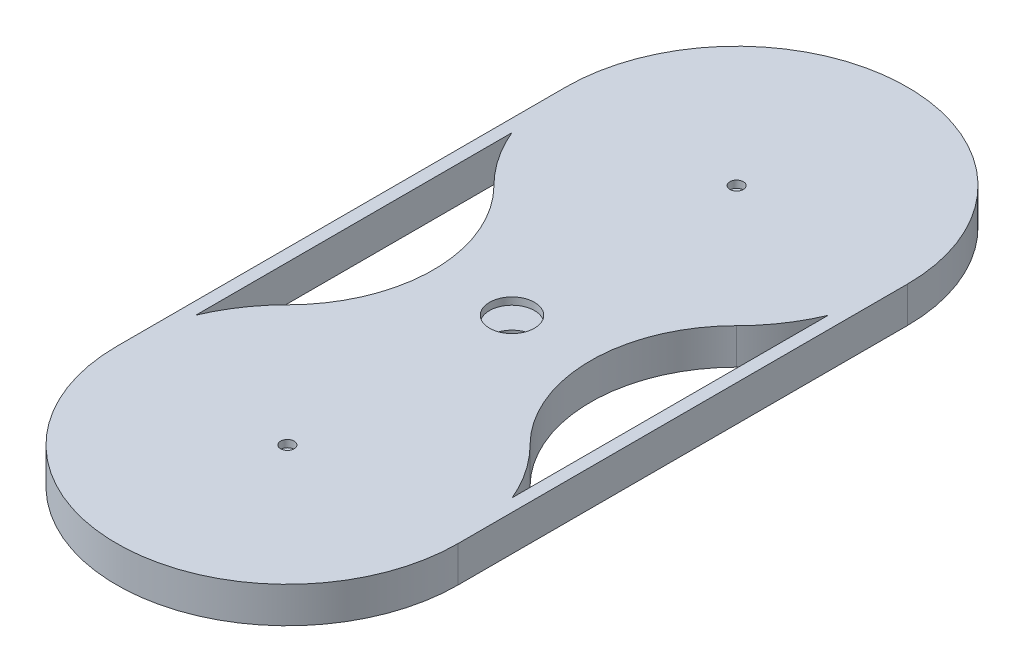
ISO-10303-21;
HEADER;
FILE_DESCRIPTION(('STEP AP214'),'2;1');
FILE_NAME('part.step','',(''),(''),'','','');
FILE_SCHEMA(('AUTOMOTIVE_DESIGN { 1 0 10303 214 1 1 1 1 }'));
ENDSEC;
DATA;
#1=APPLICATION_CONTEXT('core data for automotive mechanical design processes');
#2=APPLICATION_PROTOCOL_DEFINITION('international standard','automotive_design',2000,#1);
#3=PRODUCT_CONTEXT('',#1,'mechanical');
#4=PRODUCT('Part','Part','',(#3));
#5=PRODUCT_RELATED_PRODUCT_CATEGORY('part','',(#4));
#6=PRODUCT_DEFINITION_FORMATION('','',#4);
#7=PRODUCT_DEFINITION_CONTEXT('part definition',#1,'design');
#8=PRODUCT_DEFINITION('design','',#6,#7);
#9=PRODUCT_DEFINITION_SHAPE('','',#8);
#10=(LENGTH_UNIT() NAMED_UNIT(*) SI_UNIT(.MILLI.,.METRE.));
#11=(NAMED_UNIT(*) PLANE_ANGLE_UNIT() SI_UNIT($,.RADIAN.));
#12=(NAMED_UNIT(*) SI_UNIT($,.STERADIAN.) SOLID_ANGLE_UNIT());
#13=UNCERTAINTY_MEASURE_WITH_UNIT(LENGTH_MEASURE(1.E-05),#10,'distance_accuracy_value','');
#14=(GEOMETRIC_REPRESENTATION_CONTEXT(3) GLOBAL_UNCERTAINTY_ASSIGNED_CONTEXT((#13)) GLOBAL_UNIT_ASSIGNED_CONTEXT((#10,
#11,#12)) REPRESENTATION_CONTEXT('',''));
#15=CARTESIAN_POINT('',(0.,0.,0.));
#16=DIRECTION('',(0.,0.,1.));
#17=DIRECTION('',(1.,0.,0.));
#18=AXIS2_PLACEMENT_3D('',#15,#16,#17);
#19=CARTESIAN_POINT('',(0.,-2.,0.));
#20=DIRECTION('',(0.,1.,0.));
#21=DIRECTION('',(0.,0.,1.));
#22=AXIS2_PLACEMENT_3D('',#19,#20,#21);
#23=PLANE('',#22);
#24=CARTESIAN_POINT('',(0.,-2.,0.));
#25=DIRECTION('',(0.,1.,0.));
#26=DIRECTION('',(0.,0.,1.));
#27=AXIS2_PLACEMENT_3D('',#24,#25,#26);
#28=CIRCLE('',#27,19.1);
#29=CARTESIAN_POINT('',(13.505739520663,-2.,13.5057395206631));
#30=VERTEX_POINT('',#29);
#31=CARTESIAN_POINT('',(17.6,-2.,7.41956872061983));
#32=VERTEX_POINT('',#31);
#33=EDGE_CURVE('E316',#30,#32,#28,.T.);
#34=ORIENTED_EDGE('',*,*,#33,.F.);
#35=CARTESIAN_POINT('',(25.,-2.,25.));
#36=DIRECTION('',(0.,1.,0.));
#37=DIRECTION('',(0.,0.,1.));
#38=AXIS2_PLACEMENT_3D('',#35,#36,#37);
#39=CIRCLE('',#38,16.2553390593274);
#40=CARTESIAN_POINT('',(13.5057395206631,-2.,36.494260479337));
#41=VERTEX_POINT('',#40);
#42=EDGE_CURVE('E321',#41,#30,#39,.F.);
#43=ORIENTED_EDGE('',*,*,#42,.F.);
#44=CARTESIAN_POINT('',(0.,-2.,50.));
#45=DIRECTION('',(0.,1.,0.));
#46=DIRECTION('',(0.,0.,1.));
#47=AXIS2_PLACEMENT_3D('',#44,#45,#46);
#48=CIRCLE('',#47,19.1);
#49=CARTESIAN_POINT('',(17.6,-2.,42.5804312793802));
#50=VERTEX_POINT('',#49);
#51=EDGE_CURVE('E179',#50,#41,#48,.T.);
#52=ORIENTED_EDGE('',*,*,#51,.F.);
#53=DIRECTION('',(0.,0.,1.));
#54=VECTOR('',#53,1.);
#55=CARTESIAN_POINT('',(17.6,-2.,0.));
#56=LINE('',#55,#54);
#57=EDGE_CURVE('E318',#32,#50,#56,.T.);
#58=ORIENTED_EDGE('',*,*,#57,.F.);
#59=EDGE_LOOP('',(#34,#43,#52,#58));
#60=FACE_BOUND('',#59,.T.);
#61=CARTESIAN_POINT('',(0.,-2.,50.));
#62=DIRECTION('',(0.,1.,0.));
#63=DIRECTION('',(0.,0.,1.));
#64=AXIS2_PLACEMENT_3D('',#61,#62,#63);
#65=CIRCLE('',#64,19.1);
#66=CARTESIAN_POINT('',(-13.505739520663,-2.,36.494260479337));
#67=VERTEX_POINT('',#66);
#68=CARTESIAN_POINT('',(-17.6,-2.,42.5804312793802));
#69=VERTEX_POINT('',#68);
#70=EDGE_CURVE('E208',#67,#69,#65,.T.);
#71=ORIENTED_EDGE('',*,*,#70,.F.);
#72=CARTESIAN_POINT('',(-25.0000000000001,-2.,25.));
#73=DIRECTION('',(0.,1.,0.));
#74=DIRECTION('',(0.,0.,1.));
#75=AXIS2_PLACEMENT_3D('',#72,#73,#74);
#76=CIRCLE('',#75,16.2553390593275);
#77=CARTESIAN_POINT('',(-13.5057395206631,-2.,13.505739520663));
#78=VERTEX_POINT('',#77);
#79=EDGE_CURVE('E303',#78,#67,#76,.F.);
#80=ORIENTED_EDGE('',*,*,#79,.F.);
#81=CARTESIAN_POINT('',(0.,-2.,0.));
#82=DIRECTION('',(0.,1.,0.));
#83=DIRECTION('',(0.,0.,1.));
#84=AXIS2_PLACEMENT_3D('',#81,#82,#83);
#85=CIRCLE('',#84,19.0999999999999);
#86=CARTESIAN_POINT('',(-17.6,-2.,7.41956872061955));
#87=VERTEX_POINT('',#86);
#88=EDGE_CURVE('E300',#87,#78,#85,.T.);
#89=ORIENTED_EDGE('',*,*,#88,.F.);
#90=DIRECTION('',(0.,0.,-1.));
#91=VECTOR('',#90,1.);
#92=CARTESIAN_POINT('',(-17.6,-2.,0.));
#93=LINE('',#92,#91);
#94=EDGE_CURVE('E298',#69,#87,#93,.T.);
#95=ORIENTED_EDGE('',*,*,#94,.F.);
#96=EDGE_LOOP('',(#71,#80,#89,#95));
#97=FACE_BOUND('',#96,.T.);
#98=CARTESIAN_POINT('',(0.,-2.,25.));
#99=DIRECTION('',(0.,-1.,0.));
#100=DIRECTION('',(0.,0.,-1.));
#101=AXIS2_PLACEMENT_3D('',#98,#99,#100);
#102=CIRCLE('',#101,2.5);
#103=CARTESIAN_POINT('',(0.,-2.,22.5));
#104=VERTEX_POINT('',#103);
#105=EDGE_CURVE('E213',#104,#104,#102,.T.);
#106=ORIENTED_EDGE('',*,*,#105,.F.);
#107=EDGE_LOOP('',(#106));
#108=FACE_BOUND('',#107,.T.);
#109=CARTESIAN_POINT('',(0.,-2.,50.));
#110=DIRECTION('',(0.,-1.,0.));
#111=DIRECTION('',(0.,0.,-1.));
#112=AXIS2_PLACEMENT_3D('',#109,#110,#111);
#113=CIRCLE('',#112,2.2);
#114=CARTESIAN_POINT('',(0.,-2.,47.8));
#115=VERTEX_POINT('',#114);
#116=EDGE_CURVE('E218',#115,#115,#113,.T.);
#117=ORIENTED_EDGE('',*,*,#116,.F.);
#118=EDGE_LOOP('',(#117));
#119=FACE_BOUND('',#118,.T.);
#120=CARTESIAN_POINT('',(0.,-2.,0.));
#121=DIRECTION('',(0.,-1.,0.));
#122=DIRECTION('',(0.,0.,-1.));
#123=AXIS2_PLACEMENT_3D('',#120,#121,#122);
#124=CIRCLE('',#123,2.2);
#125=CARTESIAN_POINT('',(0.,-2.,-2.2));
#126=VERTEX_POINT('',#125);
#127=EDGE_CURVE('E217',#126,#126,#124,.T.);
#128=ORIENTED_EDGE('',*,*,#127,.F.);
#129=EDGE_LOOP('',(#128));
#130=FACE_BOUND('',#129,.T.);
#131=CARTESIAN_POINT('',(0.,-2.,0.));
#132=DIRECTION('',(0.,1.,0.));
#133=DIRECTION('',(0.,0.,1.));
#134=AXIS2_PLACEMENT_3D('',#131,#132,#133);
#135=CIRCLE('',#134,19.);
#136=CARTESIAN_POINT('',(19.,-2.,0.));
#137=VERTEX_POINT('',#136);
#138=CARTESIAN_POINT('',(-19.,-2.,0.));
#139=VERTEX_POINT('',#138);
#140=EDGE_CURVE('E239',#137,#139,#135,.T.);
#141=ORIENTED_EDGE('',*,*,#140,.F.);
#142=DIRECTION('',(0.,0.,-1.));
#143=VECTOR('',#142,1.);
#144=CARTESIAN_POINT('',(19.,-2.,0.));
#145=LINE('',#144,#143);
#146=CARTESIAN_POINT('',(19.,-2.,50.));
#147=VERTEX_POINT('',#146);
#148=EDGE_CURVE('E226',#147,#137,#145,.T.);
#149=ORIENTED_EDGE('',*,*,#148,.F.);
#150=CARTESIAN_POINT('',(0.,-2.,50.));
#151=DIRECTION('',(0.,1.,0.));
#152=DIRECTION('',(0.,0.,1.));
#153=AXIS2_PLACEMENT_3D('',#150,#151,#152);
#154=CIRCLE('',#153,19.);
#155=CARTESIAN_POINT('',(-19.,-2.,50.));
#156=VERTEX_POINT('',#155);
#157=EDGE_CURVE('E233',#156,#147,#154,.T.);
#158=ORIENTED_EDGE('',*,*,#157,.F.);
#159=DIRECTION('',(0.,0.,1.));
#160=VECTOR('',#159,1.);
#161=CARTESIAN_POINT('',(-19.,-2.,0.));
#162=LINE('',#161,#160);
#163=EDGE_CURVE('E236',#139,#156,#162,.T.);
#164=ORIENTED_EDGE('',*,*,#163,.F.);
#165=EDGE_LOOP('',(#141,#149,#158,#164));
#166=FACE_BOUND('',#165,.T.);
#167=ADVANCED_FACE('F57',(#60,#97,#108,#119,#130,#166),#23,.F.);
#168=CARTESIAN_POINT('',(0.,-2.,0.));
#169=DIRECTION('',(0.,1.,0.));
#170=DIRECTION('',(0.,0.,1.));
#171=AXIS2_PLACEMENT_3D('',#168,#169,#170);
#172=CYLINDRICAL_SURFACE('',#171,19.);
#173=DIRECTION('',(0.,1.,0.));
#174=VECTOR('',#173,1.);
#175=CARTESIAN_POINT('',(-19.,-2.,0.));
#176=LINE('',#175,#174);
#177=CARTESIAN_POINT('',(-19.,2.,0.));
#178=VERTEX_POINT('',#177);
#179=EDGE_CURVE('E223',#139,#178,#176,.T.);
#180=ORIENTED_EDGE('',*,*,#179,.T.);
#181=CARTESIAN_POINT('',(0.,2.,0.));
#182=DIRECTION('',(0.,1.,0.));
#183=DIRECTION('',(0.,0.,1.));
#184=AXIS2_PLACEMENT_3D('',#181,#182,#183);
#185=CIRCLE('',#184,19.);
#186=CARTESIAN_POINT('',(19.,2.,0.));
#187=VERTEX_POINT('',#186);
#188=EDGE_CURVE('E251',#187,#178,#185,.T.);
#189=ORIENTED_EDGE('',*,*,#188,.F.);
#190=DIRECTION('',(0.,1.,0.));
#191=VECTOR('',#190,1.);
#192=CARTESIAN_POINT('',(19.,-2.,0.));
#193=LINE('',#192,#191);
#194=EDGE_CURVE('E199',#137,#187,#193,.T.);
#195=ORIENTED_EDGE('',*,*,#194,.F.);
#196=ORIENTED_EDGE('',*,*,#140,.T.);
#197=EDGE_LOOP('',(#180,#189,#195,#196));
#198=FACE_BOUND('',#197,.T.);
#199=ADVANCED_FACE('F59',(#198),#172,.T.);
#200=CARTESIAN_POINT('',(19.,-2.,0.));
#201=DIRECTION('',(1.,0.,0.));
#202=DIRECTION('',(0.,0.,-1.));
#203=AXIS2_PLACEMENT_3D('',#200,#201,#202);
#204=PLANE('',#203);
#205=ORIENTED_EDGE('',*,*,#194,.T.);
#206=DIRECTION('',(0.,0.,-1.));
#207=VECTOR('',#206,1.);
#208=CARTESIAN_POINT('',(19.,2.,0.));
#209=LINE('',#208,#207);
#210=CARTESIAN_POINT('',(19.,2.,50.));
#211=VERTEX_POINT('',#210);
#212=EDGE_CURVE('E242',#211,#187,#209,.T.);
#213=ORIENTED_EDGE('',*,*,#212,.F.);
#214=DIRECTION('',(0.,1.,0.));
#215=VECTOR('',#214,1.);
#216=CARTESIAN_POINT('',(19.,-2.,50.));
#217=LINE('',#216,#215);
#218=EDGE_CURVE('E228',#147,#211,#217,.T.);
#219=ORIENTED_EDGE('',*,*,#218,.F.);
#220=ORIENTED_EDGE('',*,*,#148,.T.);
#221=EDGE_LOOP('',(#205,#213,#219,#220));
#222=FACE_BOUND('',#221,.T.);
#223=ADVANCED_FACE('F352',(#222),#204,.T.);
#224=CARTESIAN_POINT('',(0.,-2.,50.));
#225=DIRECTION('',(0.,1.,0.));
#226=DIRECTION('',(0.,0.,1.));
#227=AXIS2_PLACEMENT_3D('',#224,#225,#226);
#228=CYLINDRICAL_SURFACE('',#227,19.);
#229=ORIENTED_EDGE('',*,*,#218,.T.);
#230=CARTESIAN_POINT('',(0.,2.,50.));
#231=DIRECTION('',(0.,1.,0.));
#232=DIRECTION('',(0.,0.,1.));
#233=AXIS2_PLACEMENT_3D('',#230,#231,#232);
#234=CIRCLE('',#233,19.);
#235=CARTESIAN_POINT('',(-19.,2.,50.));
#236=VERTEX_POINT('',#235);
#237=EDGE_CURVE('E245',#236,#211,#234,.T.);
#238=ORIENTED_EDGE('',*,*,#237,.F.);
#239=DIRECTION('',(0.,1.,0.));
#240=VECTOR('',#239,1.);
#241=CARTESIAN_POINT('',(-19.,-2.,50.));
#242=LINE('',#241,#240);
#243=EDGE_CURVE('E225',#156,#236,#242,.T.);
#244=ORIENTED_EDGE('',*,*,#243,.F.);
#245=ORIENTED_EDGE('',*,*,#157,.T.);
#246=EDGE_LOOP('',(#229,#238,#244,#245));
#247=FACE_BOUND('',#246,.T.);
#248=ADVANCED_FACE('F359',(#247),#228,.T.);
#249=CARTESIAN_POINT('',(-19.,-2.,0.));
#250=DIRECTION('',(-1.,0.,0.));
#251=DIRECTION('',(0.,0.,1.));
#252=AXIS2_PLACEMENT_3D('',#249,#250,#251);
#253=PLANE('',#252);
#254=ORIENTED_EDGE('',*,*,#243,.T.);
#255=DIRECTION('',(0.,0.,1.));
#256=VECTOR('',#255,1.);
#257=CARTESIAN_POINT('',(-19.,2.,0.));
#258=LINE('',#257,#256);
#259=EDGE_CURVE('E248',#178,#236,#258,.T.);
#260=ORIENTED_EDGE('',*,*,#259,.F.);
#261=ORIENTED_EDGE('',*,*,#179,.F.);
#262=ORIENTED_EDGE('',*,*,#163,.T.);
#263=EDGE_LOOP('',(#254,#260,#261,#262));
#264=FACE_BOUND('',#263,.T.);
#265=ADVANCED_FACE('F362',(#264),#253,.T.);
#266=CARTESIAN_POINT('',(0.,2.,0.));
#267=DIRECTION('',(0.,1.,0.));
#268=DIRECTION('',(0.,0.,1.));
#269=AXIS2_PLACEMENT_3D('',#266,#267,#268);
#270=PLANE('',#269);
#271=CARTESIAN_POINT('',(25.,2.,25.));
#272=DIRECTION('',(0.,1.,0.));
#273=DIRECTION('',(0.,0.,1.));
#274=AXIS2_PLACEMENT_3D('',#271,#272,#273);
#275=CIRCLE('',#274,16.2553390593274);
#276=CARTESIAN_POINT('',(13.5057395206631,2.,36.494260479337));
#277=VERTEX_POINT('',#276);
#278=CARTESIAN_POINT('',(13.505739520663,2.,13.5057395206631));
#279=VERTEX_POINT('',#278);
#280=EDGE_CURVE('E167',#277,#279,#275,.F.);
#281=ORIENTED_EDGE('',*,*,#280,.T.);
#282=CARTESIAN_POINT('',(0.,2.,0.));
#283=DIRECTION('',(0.,1.,0.));
#284=DIRECTION('',(0.,0.,1.));
#285=AXIS2_PLACEMENT_3D('',#282,#283,#284);
#286=CIRCLE('',#285,19.1);
#287=CARTESIAN_POINT('',(17.6,2.,7.41956872061983));
#288=VERTEX_POINT('',#287);
#289=EDGE_CURVE('E12',#279,#288,#286,.T.);
#290=ORIENTED_EDGE('',*,*,#289,.T.);
#291=DIRECTION('',(0.,0.,1.));
#292=VECTOR('',#291,1.);
#293=CARTESIAN_POINT('',(17.6,2.,0.));
#294=LINE('',#293,#292);
#295=CARTESIAN_POINT('',(17.6,2.,42.5804312793802));
#296=VERTEX_POINT('',#295);
#297=EDGE_CURVE('E65',#288,#296,#294,.T.);
#298=ORIENTED_EDGE('',*,*,#297,.T.);
#299=CARTESIAN_POINT('',(0.,2.,50.));
#300=DIRECTION('',(0.,1.,0.));
#301=DIRECTION('',(0.,0.,1.));
#302=AXIS2_PLACEMENT_3D('',#299,#300,#301);
#303=CIRCLE('',#302,19.1);
#304=EDGE_CURVE('E171',#296,#277,#303,.T.);
#305=ORIENTED_EDGE('',*,*,#304,.T.);
#306=EDGE_LOOP('',(#281,#290,#298,#305));
#307=FACE_BOUND('',#306,.T.);
#308=CARTESIAN_POINT('',(-25.0000000000001,2.,25.));
#309=DIRECTION('',(0.,1.,0.));
#310=DIRECTION('',(0.,0.,1.));
#311=AXIS2_PLACEMENT_3D('',#308,#309,#310);
#312=CIRCLE('',#311,16.2553390593275);
#313=CARTESIAN_POINT('',(-13.505739520663,2.,13.505739520663));
#314=VERTEX_POINT('',#313);
#315=CARTESIAN_POINT('',(-13.505739520663,2.,36.494260479337));
#316=VERTEX_POINT('',#315);
#317=EDGE_CURVE('E196',#314,#316,#312,.F.);
#318=ORIENTED_EDGE('',*,*,#317,.T.);
#319=CARTESIAN_POINT('',(0.,2.,50.));
#320=DIRECTION('',(0.,1.,0.));
#321=DIRECTION('',(0.,0.,1.));
#322=AXIS2_PLACEMENT_3D('',#319,#320,#321);
#323=CIRCLE('',#322,19.1);
#324=CARTESIAN_POINT('',(-17.6,2.,42.5804312793802));
#325=VERTEX_POINT('',#324);
#326=EDGE_CURVE('E172',#316,#325,#323,.T.);
#327=ORIENTED_EDGE('',*,*,#326,.T.);
#328=DIRECTION('',(0.,0.,-1.));
#329=VECTOR('',#328,1.);
#330=CARTESIAN_POINT('',(-17.6,2.,0.));
#331=LINE('',#330,#329);
#332=CARTESIAN_POINT('',(-17.6,2.,7.41956872061955));
#333=VERTEX_POINT('',#332);
#334=EDGE_CURVE('E190',#325,#333,#331,.T.);
#335=ORIENTED_EDGE('',*,*,#334,.T.);
#336=CARTESIAN_POINT('',(0.,2.,0.));
#337=DIRECTION('',(0.,1.,0.));
#338=DIRECTION('',(0.,0.,1.));
#339=AXIS2_PLACEMENT_3D('',#336,#337,#338);
#340=CIRCLE('',#339,19.0999999999999);
#341=EDGE_CURVE('E193',#333,#314,#340,.T.);
#342=ORIENTED_EDGE('',*,*,#341,.T.);
#343=EDGE_LOOP('',(#318,#327,#335,#342));
#344=FACE_BOUND('',#343,.T.);
#345=CARTESIAN_POINT('',(0.,2.,50.));
#346=DIRECTION('',(0.,1.,0.));
#347=DIRECTION('',(0.,0.,1.));
#348=AXIS2_PLACEMENT_3D('',#345,#346,#347);
#349=CIRCLE('',#348,0.75);
#350=CARTESIAN_POINT('',(0.,2.,50.75));
#351=VERTEX_POINT('',#350);
#352=EDGE_CURVE('E203',#351,#351,#349,.T.);
#353=ORIENTED_EDGE('',*,*,#352,.F.);
#354=EDGE_LOOP('',(#353));
#355=FACE_BOUND('',#354,.T.);
#356=CARTESIAN_POINT('',(0.,2.,0.));
#357=DIRECTION('',(0.,1.,0.));
#358=DIRECTION('',(0.,0.,1.));
#359=AXIS2_PLACEMENT_3D('',#356,#357,#358);
#360=CIRCLE('',#359,0.75);
#361=CARTESIAN_POINT('',(0.,2.,0.75));
#362=VERTEX_POINT('',#361);
#363=EDGE_CURVE('E204',#362,#362,#360,.T.);
#364=ORIENTED_EDGE('',*,*,#363,.F.);
#365=EDGE_LOOP('',(#364));
#366=FACE_BOUND('',#365,.T.);
#367=CARTESIAN_POINT('',(0.,2.,25.));
#368=DIRECTION('',(0.,1.,0.));
#369=DIRECTION('',(0.,0.,1.));
#370=AXIS2_PLACEMENT_3D('',#367,#368,#369);
#371=CIRCLE('',#370,2.5);
#372=CARTESIAN_POINT('',(0.,2.,27.5));
#373=VERTEX_POINT('',#372);
#374=EDGE_CURVE('E286',#373,#373,#371,.T.);
#375=ORIENTED_EDGE('',*,*,#374,.F.);
#376=EDGE_LOOP('',(#375));
#377=FACE_BOUND('',#376,.T.);
#378=ORIENTED_EDGE('',*,*,#188,.T.);
#379=ORIENTED_EDGE('',*,*,#259,.T.);
#380=ORIENTED_EDGE('',*,*,#237,.T.);
#381=ORIENTED_EDGE('',*,*,#212,.T.);
#382=EDGE_LOOP('',(#378,#379,#380,#381));
#383=FACE_BOUND('',#382,.T.);
#384=ADVANCED_FACE('F184',(#307,#344,#355,#366,#377,#383),#270,.T.);
#385=CARTESIAN_POINT('',(0.,0.2,0.));
#386=DIRECTION('',(0.,-1.,0.));
#387=DIRECTION('',(0.,0.,-1.));
#388=AXIS2_PLACEMENT_3D('',#385,#386,#387);
#389=CYLINDRICAL_SURFACE('',#388,2.2);
#390=CARTESIAN_POINT('',(0.,-1.2,0.));
#391=DIRECTION('',(0.,1.,0.));
#392=DIRECTION('',(0.,0.,1.));
#393=AXIS2_PLACEMENT_3D('',#390,#391,#392);
#394=CIRCLE('',#393,2.2);
#395=CARTESIAN_POINT('',(0.,-1.2,2.2));
#396=VERTEX_POINT('',#395);
#397=EDGE_CURVE('E219',#396,#396,#394,.T.);
#398=ORIENTED_EDGE('',*,*,#397,.T.);
#399=EDGE_LOOP('',(#398));
#400=FACE_BOUND('',#399,.T.);
#401=ORIENTED_EDGE('',*,*,#127,.T.);
#402=EDGE_LOOP('',(#401));
#403=FACE_BOUND('',#402,.T.);
#404=ADVANCED_FACE('F369',(#400,#403),#389,.F.);
#405=CARTESIAN_POINT('',(25.,1.2,25.));
#406=DIRECTION('',(0.,-1.,0.));
#407=DIRECTION('',(0.,0.,-1.));
#408=AXIS2_PLACEMENT_3D('',#405,#406,#407);
#409=CYLINDRICAL_SURFACE('',#408,17.7553390593274);
#410=DIRECTION('',(0.,-1.,0.));
#411=VECTOR('',#410,1.);
#412=CARTESIAN_POINT('',(12.4450793488832,1.2,37.5549206511168));
#413=LINE('',#412,#411);
#414=CARTESIAN_POINT('',(12.4450793488832,1.2,37.5549206511168));
#415=VERTEX_POINT('',#414);
#416=CARTESIAN_POINT('',(12.4450793488832,-1.2,37.5549206511168));
#417=VERTEX_POINT('',#416);
#418=EDGE_CURVE('E260',#415,#417,#413,.T.);
#419=ORIENTED_EDGE('',*,*,#418,.F.);
#420=CARTESIAN_POINT('',(25.,1.2,25.));
#421=DIRECTION('',(0.,1.,0.));
#422=DIRECTION('',(0.,0.,1.));
#423=AXIS2_PLACEMENT_3D('',#420,#421,#422);
#424=CIRCLE('',#423,17.7553390593274);
#425=CARTESIAN_POINT('',(12.4450793488832,1.2,12.4450793488832));
#426=VERTEX_POINT('',#425);
#427=EDGE_CURVE('E268',#426,#415,#424,.T.);
#428=ORIENTED_EDGE('',*,*,#427,.F.);
#429=DIRECTION('',(0.,-1.,0.));
#430=VECTOR('',#429,1.);
#431=CARTESIAN_POINT('',(12.4450793488832,1.2,12.4450793488832));
#432=LINE('',#431,#430);
#433=CARTESIAN_POINT('',(12.4450793488832,-1.2,12.4450793488832));
#434=VERTEX_POINT('',#433);
#435=EDGE_CURVE('E254',#426,#434,#432,.T.);
#436=ORIENTED_EDGE('',*,*,#435,.T.);
#437=CARTESIAN_POINT('',(25.,-1.2,25.));
#438=DIRECTION('',(0.,1.,0.));
#439=DIRECTION('',(0.,0.,1.));
#440=AXIS2_PLACEMENT_3D('',#437,#438,#439);
#441=CIRCLE('',#440,17.7553390593274);
#442=EDGE_CURVE('E222',#434,#417,#441,.T.);
#443=ORIENTED_EDGE('',*,*,#442,.T.);
#444=EDGE_LOOP('',(#419,#428,#436,#443));
#445=FACE_BOUND('',#444,.T.);
#446=ADVANCED_FACE('F383',(#445),#409,.T.);
#447=CARTESIAN_POINT('',(0.,1.2,0.));
#448=DIRECTION('',(0.,-1.,0.));
#449=DIRECTION('',(0.,0.,-1.));
#450=AXIS2_PLACEMENT_3D('',#447,#448,#449);
#451=CYLINDRICAL_SURFACE('',#450,17.6);
#452=ORIENTED_EDGE('',*,*,#435,.F.);
#453=CARTESIAN_POINT('',(0.,1.2,0.));
#454=DIRECTION('',(0.,1.,0.));
#455=DIRECTION('',(0.,0.,1.));
#456=AXIS2_PLACEMENT_3D('',#453,#454,#455);
#457=CIRCLE('',#456,17.6);
#458=CARTESIAN_POINT('',(-12.4450793488833,1.2,12.4450793488832));
#459=VERTEX_POINT('',#458);
#460=EDGE_CURVE('E266',#426,#459,#457,.T.);
#461=ORIENTED_EDGE('',*,*,#460,.T.);
#462=DIRECTION('',(0.,-1.,0.));
#463=VECTOR('',#462,1.);
#464=CARTESIAN_POINT('',(-12.4450793488833,1.2,12.4450793488832));
#465=LINE('',#464,#463);
#466=CARTESIAN_POINT('',(-12.4450793488833,-1.2,12.4450793488832));
#467=VERTEX_POINT('',#466);
#468=EDGE_CURVE('E256',#459,#467,#465,.T.);
#469=ORIENTED_EDGE('',*,*,#468,.T.);
#470=CARTESIAN_POINT('',(0.,-1.2,0.));
#471=DIRECTION('',(0.,1.,0.));
#472=DIRECTION('',(0.,0.,1.));
#473=AXIS2_PLACEMENT_3D('',#470,#471,#472);
#474=CIRCLE('',#473,17.6);
#475=EDGE_CURVE('E277',#434,#467,#474,.T.);
#476=ORIENTED_EDGE('',*,*,#475,.F.);
#477=EDGE_LOOP('',(#452,#461,#469,#476));
#478=FACE_BOUND('',#477,.T.);
#479=ADVANCED_FACE('F389',(#478),#451,.F.);
#480=CARTESIAN_POINT('',(-25.0000000000001,1.2,25.));
#481=DIRECTION('',(0.,-1.,0.));
#482=DIRECTION('',(0.,0.,-1.));
#483=AXIS2_PLACEMENT_3D('',#480,#481,#482);
#484=CYLINDRICAL_SURFACE('',#483,17.7553390593275);
#485=ORIENTED_EDGE('',*,*,#468,.F.);
#486=CARTESIAN_POINT('',(-25.0000000000001,1.2,25.));
#487=DIRECTION('',(0.,1.,0.));
#488=DIRECTION('',(0.,0.,1.));
#489=AXIS2_PLACEMENT_3D('',#486,#487,#488);
#490=CIRCLE('',#489,17.7553390593275);
#491=CARTESIAN_POINT('',(-12.4450793488832,1.2,37.5549206511168));
#492=VERTEX_POINT('',#491);
#493=EDGE_CURVE('E264',#459,#492,#490,.F.);
#494=ORIENTED_EDGE('',*,*,#493,.T.);
#495=DIRECTION('',(0.,-1.,0.));
#496=VECTOR('',#495,1.);
#497=CARTESIAN_POINT('',(-12.4450793488832,1.2,37.5549206511168));
#498=LINE('',#497,#496);
#499=CARTESIAN_POINT('',(-12.4450793488832,-1.2,37.5549206511168));
#500=VERTEX_POINT('',#499);
#501=EDGE_CURVE('E258',#492,#500,#498,.T.);
#502=ORIENTED_EDGE('',*,*,#501,.T.);
#503=CARTESIAN_POINT('',(-25.0000000000001,-1.2,25.));
#504=DIRECTION('',(0.,1.,0.));
#505=DIRECTION('',(0.,0.,1.));
#506=AXIS2_PLACEMENT_3D('',#503,#504,#505);
#507=CIRCLE('',#506,17.7553390593275);
#508=EDGE_CURVE('E274',#467,#500,#507,.F.);
#509=ORIENTED_EDGE('',*,*,#508,.F.);
#510=EDGE_LOOP('',(#485,#494,#502,#509));
#511=FACE_BOUND('',#510,.T.);
#512=ADVANCED_FACE('F407',(#511),#484,.T.);
#513=CARTESIAN_POINT('',(0.,1.2,50.));
#514=DIRECTION('',(0.,-1.,0.));
#515=DIRECTION('',(0.,0.,-1.));
#516=AXIS2_PLACEMENT_3D('',#513,#514,#515);
#517=CYLINDRICAL_SURFACE('',#516,17.6);
#518=ORIENTED_EDGE('',*,*,#501,.F.);
#519=CARTESIAN_POINT('',(0.,1.2,50.));
#520=DIRECTION('',(0.,1.,0.));
#521=DIRECTION('',(0.,0.,1.));
#522=AXIS2_PLACEMENT_3D('',#519,#520,#521);
#523=CIRCLE('',#522,17.6);
#524=EDGE_CURVE('E262',#492,#415,#523,.T.);
#525=ORIENTED_EDGE('',*,*,#524,.T.);
#526=ORIENTED_EDGE('',*,*,#418,.T.);
#527=CARTESIAN_POINT('',(0.,-1.2,50.));
#528=DIRECTION('',(0.,1.,0.));
#529=DIRECTION('',(0.,0.,1.));
#530=AXIS2_PLACEMENT_3D('',#527,#528,#529);
#531=CIRCLE('',#530,17.6);
#532=EDGE_CURVE('E271',#500,#417,#531,.T.);
#533=ORIENTED_EDGE('',*,*,#532,.F.);
#534=EDGE_LOOP('',(#518,#525,#526,#533));
#535=FACE_BOUND('',#534,.T.);
#536=ADVANCED_FACE('F403',(#535),#517,.F.);
#537=CARTESIAN_POINT('',(0.,1.2,0.));
#538=DIRECTION('',(0.,1.,0.));
#539=DIRECTION('',(0.,0.,1.));
#540=AXIS2_PLACEMENT_3D('',#537,#538,#539);
#541=PLANE('',#540);
#542=CARTESIAN_POINT('',(0.,1.2,50.));
#543=DIRECTION('',(0.,1.,0.));
#544=DIRECTION('',(0.,0.,1.));
#545=AXIS2_PLACEMENT_3D('',#542,#543,#544);
#546=CIRCLE('',#545,0.75);
#547=CARTESIAN_POINT('',(0.,1.2,50.75));
#548=VERTEX_POINT('',#547);
#549=EDGE_CURVE('E200',#548,#548,#546,.T.);
#550=ORIENTED_EDGE('',*,*,#549,.T.);
#551=EDGE_LOOP('',(#550));
#552=FACE_BOUND('',#551,.T.);
#553=CARTESIAN_POINT('',(0.,1.2,0.));
#554=DIRECTION('',(0.,1.,0.));
#555=DIRECTION('',(0.,0.,1.));
#556=AXIS2_PLACEMENT_3D('',#553,#554,#555);
#557=CIRCLE('',#556,0.75);
#558=CARTESIAN_POINT('',(0.,1.2,0.75));
#559=VERTEX_POINT('',#558);
#560=EDGE_CURVE('E205',#559,#559,#557,.T.);
#561=ORIENTED_EDGE('',*,*,#560,.T.);
#562=EDGE_LOOP('',(#561));
#563=FACE_BOUND('',#562,.T.);
#564=CARTESIAN_POINT('',(0.,1.2,25.));
#565=DIRECTION('',(0.,1.,0.));
#566=DIRECTION('',(0.,0.,1.));
#567=AXIS2_PLACEMENT_3D('',#564,#565,#566);
#568=CIRCLE('',#567,2.5);
#569=CARTESIAN_POINT('',(0.,1.2,27.5));
#570=VERTEX_POINT('',#569);
#571=EDGE_CURVE('E212',#570,#570,#568,.T.);
#572=ORIENTED_EDGE('',*,*,#571,.T.);
#573=EDGE_LOOP('',(#572));
#574=FACE_BOUND('',#573,.T.);
#575=ORIENTED_EDGE('',*,*,#427,.T.);
#576=ORIENTED_EDGE('',*,*,#524,.F.);
#577=ORIENTED_EDGE('',*,*,#493,.F.);
#578=ORIENTED_EDGE('',*,*,#460,.F.);
#579=EDGE_LOOP('',(#575,#576,#577,#578));
#580=FACE_BOUND('',#579,.T.);
#581=ADVANCED_FACE('F399',(#552,#563,#574,#580),#541,.F.);
#582=CARTESIAN_POINT('',(0.,-1.2,0.));
#583=DIRECTION('',(0.,1.,0.));
#584=DIRECTION('',(0.,0.,1.));
#585=AXIS2_PLACEMENT_3D('',#582,#583,#584);
#586=PLANE('',#585);
#587=CARTESIAN_POINT('',(0.,-1.2,25.));
#588=DIRECTION('',(0.,1.,0.));
#589=DIRECTION('',(0.,0.,1.));
#590=AXIS2_PLACEMENT_3D('',#587,#588,#589);
#591=CIRCLE('',#590,2.5);
#592=CARTESIAN_POINT('',(0.,-1.2,27.5));
#593=VERTEX_POINT('',#592);
#594=EDGE_CURVE('E209',#593,#593,#591,.T.);
#595=ORIENTED_EDGE('',*,*,#594,.F.);
#596=EDGE_LOOP('',(#595));
#597=FACE_BOUND('',#596,.T.);
#598=CARTESIAN_POINT('',(0.,-1.2,50.));
#599=DIRECTION('',(0.,1.,0.));
#600=DIRECTION('',(0.,0.,1.));
#601=AXIS2_PLACEMENT_3D('',#598,#599,#600);
#602=CIRCLE('',#601,2.2);
#603=CARTESIAN_POINT('',(0.,-1.2,52.2));
#604=VERTEX_POINT('',#603);
#605=EDGE_CURVE('E214',#604,#604,#602,.T.);
#606=ORIENTED_EDGE('',*,*,#605,.F.);
#607=EDGE_LOOP('',(#606));
#608=FACE_BOUND('',#607,.T.);
#609=ORIENTED_EDGE('',*,*,#397,.F.);
#610=EDGE_LOOP('',(#609));
#611=FACE_BOUND('',#610,.T.);
#612=ORIENTED_EDGE('',*,*,#442,.F.);
#613=ORIENTED_EDGE('',*,*,#475,.T.);
#614=ORIENTED_EDGE('',*,*,#508,.T.);
#615=ORIENTED_EDGE('',*,*,#532,.T.);
#616=EDGE_LOOP('',(#612,#613,#614,#615));
#617=FACE_BOUND('',#616,.T.);
#618=ADVANCED_FACE('F396',(#597,#608,#611,#617),#586,.T.);
#619=CARTESIAN_POINT('',(0.,0.2,50.));
#620=DIRECTION('',(0.,-1.,0.));
#621=DIRECTION('',(0.,0.,-1.));
#622=AXIS2_PLACEMENT_3D('',#619,#620,#621);
#623=CYLINDRICAL_SURFACE('',#622,2.2);
#624=ORIENTED_EDGE('',*,*,#605,.T.);
#625=EDGE_LOOP('',(#624));
#626=FACE_BOUND('',#625,.T.);
#627=ORIENTED_EDGE('',*,*,#116,.T.);
#628=EDGE_LOOP('',(#627));
#629=FACE_BOUND('',#628,.T.);
#630=ADVANCED_FACE('F394',(#626,#629),#623,.F.);
#631=CARTESIAN_POINT('',(0.,8.2,25.));
#632=DIRECTION('',(0.,-1.,0.));
#633=DIRECTION('',(0.,0.,-1.));
#634=AXIS2_PLACEMENT_3D('',#631,#632,#633);
#635=CYLINDRICAL_SURFACE('',#634,2.5);
#636=ORIENTED_EDGE('',*,*,#594,.T.);
#637=EDGE_LOOP('',(#636));
#638=FACE_BOUND('',#637,.T.);
#639=ORIENTED_EDGE('',*,*,#105,.T.);
#640=EDGE_LOOP('',(#639));
#641=FACE_BOUND('',#640,.T.);
#642=ADVANCED_FACE('F454',(#638,#641),#635,.F.);
#643=ORIENTED_EDGE('',*,*,#374,.T.);
#644=EDGE_LOOP('',(#643));
#645=FACE_BOUND('',#644,.T.);
#646=ORIENTED_EDGE('',*,*,#571,.F.);
#647=EDGE_LOOP('',(#646));
#648=FACE_BOUND('',#647,.T.);
#649=ADVANCED_FACE('F460',(#645,#648),#635,.F.);
#650=CARTESIAN_POINT('',(0.,8.2,0.));
#651=DIRECTION('',(0.,-1.,0.));
#652=DIRECTION('',(0.,0.,-1.));
#653=AXIS2_PLACEMENT_3D('',#650,#651,#652);
#654=CYLINDRICAL_SURFACE('',#653,0.75);
#655=ORIENTED_EDGE('',*,*,#363,.T.);
#656=EDGE_LOOP('',(#655));
#657=FACE_BOUND('',#656,.T.);
#658=ORIENTED_EDGE('',*,*,#560,.F.);
#659=EDGE_LOOP('',(#658));
#660=FACE_BOUND('',#659,.T.);
#661=ADVANCED_FACE('F467',(#657,#660),#654,.F.);
#662=CARTESIAN_POINT('',(0.,8.2,50.));
#663=DIRECTION('',(0.,-1.,0.));
#664=DIRECTION('',(0.,0.,-1.));
#665=AXIS2_PLACEMENT_3D('',#662,#663,#664);
#666=CYLINDRICAL_SURFACE('',#665,0.75);
#667=ORIENTED_EDGE('',*,*,#352,.T.);
#668=EDGE_LOOP('',(#667));
#669=FACE_BOUND('',#668,.T.);
#670=ORIENTED_EDGE('',*,*,#549,.F.);
#671=EDGE_LOOP('',(#670));
#672=FACE_BOUND('',#671,.T.);
#673=ADVANCED_FACE('F474',(#669,#672),#666,.F.);
#674=CARTESIAN_POINT('',(0.,-12.,50.));
#675=DIRECTION('',(0.,1.,0.));
#676=DIRECTION('',(0.,0.,1.));
#677=AXIS2_PLACEMENT_3D('',#674,#675,#676);
#678=CYLINDRICAL_SURFACE('',#677,19.1);
#679=ORIENTED_EDGE('',*,*,#70,.T.);
#680=DIRECTION('',(0.,1.,0.));
#681=VECTOR('',#680,1.);
#682=CARTESIAN_POINT('',(-17.6,-12.,42.5804312793802));
#683=LINE('',#682,#681);
#684=EDGE_CURVE('E305',#69,#325,#683,.T.);
#685=ORIENTED_EDGE('',*,*,#684,.T.);
#686=ORIENTED_EDGE('',*,*,#326,.F.);
#687=DIRECTION('',(0.,1.,0.));
#688=VECTOR('',#687,1.);
#689=CARTESIAN_POINT('',(-13.505739520663,-12.,36.494260479337));
#690=LINE('',#689,#688);
#691=EDGE_CURVE('E314',#67,#316,#690,.T.);
#692=ORIENTED_EDGE('',*,*,#691,.F.);
#693=EDGE_LOOP('',(#679,#685,#686,#692));
#694=FACE_BOUND('',#693,.T.);
#695=ADVANCED_FACE('F482',(#694),#678,.T.);
#696=CARTESIAN_POINT('',(-17.6,-12.,7.41956872061955));
#697=DIRECTION('',(1.,0.,0.));
#698=DIRECTION('',(0.,0.,-1.));
#699=AXIS2_PLACEMENT_3D('',#696,#697,#698);
#700=PLANE('',#699);
#701=ORIENTED_EDGE('',*,*,#94,.T.);
#702=DIRECTION('',(0.,1.,0.));
#703=VECTOR('',#702,1.);
#704=CARTESIAN_POINT('',(-17.6,-12.,7.41956872061955));
#705=LINE('',#704,#703);
#706=EDGE_CURVE('E308',#87,#333,#705,.T.);
#707=ORIENTED_EDGE('',*,*,#706,.T.);
#708=ORIENTED_EDGE('',*,*,#334,.F.);
#709=ORIENTED_EDGE('',*,*,#684,.F.);
#710=EDGE_LOOP('',(#701,#707,#708,#709));
#711=FACE_BOUND('',#710,.T.);
#712=ADVANCED_FACE('F490',(#711),#700,.T.);
#713=CARTESIAN_POINT('',(0.,-12.,0.));
#714=DIRECTION('',(0.,1.,0.));
#715=DIRECTION('',(0.,0.,1.));
#716=AXIS2_PLACEMENT_3D('',#713,#714,#715);
#717=CYLINDRICAL_SURFACE('',#716,19.0999999999999);
#718=ORIENTED_EDGE('',*,*,#88,.T.);
#719=DIRECTION('',(0.,1.,0.));
#720=VECTOR('',#719,1.);
#721=CARTESIAN_POINT('',(-13.505739520663,-12.,13.505739520663));
#722=LINE('',#721,#720);
#723=EDGE_CURVE('E311',#78,#314,#722,.T.);
#724=ORIENTED_EDGE('',*,*,#723,.T.);
#725=ORIENTED_EDGE('',*,*,#341,.F.);
#726=ORIENTED_EDGE('',*,*,#706,.F.);
#727=EDGE_LOOP('',(#718,#724,#725,#726));
#728=FACE_BOUND('',#727,.T.);
#729=ADVANCED_FACE('F344',(#728),#717,.T.);
#730=CARTESIAN_POINT('',(-25.0000000000001,-12.,25.));
#731=DIRECTION('',(0.,1.,0.));
#732=DIRECTION('',(0.,0.,1.));
#733=AXIS2_PLACEMENT_3D('',#730,#731,#732);
#734=CYLINDRICAL_SURFACE('',#733,16.2553390593275);
#735=ORIENTED_EDGE('',*,*,#79,.T.);
#736=ORIENTED_EDGE('',*,*,#691,.T.);
#737=ORIENTED_EDGE('',*,*,#317,.F.);
#738=ORIENTED_EDGE('',*,*,#723,.F.);
#739=EDGE_LOOP('',(#735,#736,#737,#738));
#740=FACE_BOUND('',#739,.T.);
#741=ADVANCED_FACE('F337',(#740),#734,.F.);
#742=CARTESIAN_POINT('',(0.,-12.,0.));
#743=DIRECTION('',(0.,1.,0.));
#744=DIRECTION('',(0.,0.,1.));
#745=AXIS2_PLACEMENT_3D('',#742,#743,#744);
#746=CYLINDRICAL_SURFACE('',#745,19.1);
#747=ORIENTED_EDGE('',*,*,#33,.T.);
#748=DIRECTION('',(0.,1.,0.));
#749=VECTOR('',#748,1.);
#750=CARTESIAN_POINT('',(17.6,-12.,7.41956872061983));
#751=LINE('',#750,#749);
#752=EDGE_CURVE('E323',#32,#288,#751,.T.);
#753=ORIENTED_EDGE('',*,*,#752,.T.);
#754=ORIENTED_EDGE('',*,*,#289,.F.);
#755=DIRECTION('',(0.,1.,0.));
#756=VECTOR('',#755,1.);
#757=CARTESIAN_POINT('',(13.505739520663,-12.,13.5057395206631));
#758=LINE('',#757,#756);
#759=EDGE_CURVE('E77',#30,#279,#758,.T.);
#760=ORIENTED_EDGE('',*,*,#759,.F.);
#761=EDGE_LOOP('',(#747,#753,#754,#760));
#762=FACE_BOUND('',#761,.T.);
#763=ADVANCED_FACE('F335',(#762),#746,.T.);
#764=CARTESIAN_POINT('',(17.6,-12.,42.5804312793802));
#765=DIRECTION('',(-1.,0.,0.));
#766=DIRECTION('',(0.,0.,1.));
#767=AXIS2_PLACEMENT_3D('',#764,#765,#766);
#768=PLANE('',#767);
#769=ORIENTED_EDGE('',*,*,#57,.T.);
#770=DIRECTION('',(0.,1.,0.));
#771=VECTOR('',#770,1.);
#772=CARTESIAN_POINT('',(17.6,-12.,42.5804312793802));
#773=LINE('',#772,#771);
#774=EDGE_CURVE('E181',#50,#296,#773,.T.);
#775=ORIENTED_EDGE('',*,*,#774,.T.);
#776=ORIENTED_EDGE('',*,*,#297,.F.);
#777=ORIENTED_EDGE('',*,*,#752,.F.);
#778=EDGE_LOOP('',(#769,#775,#776,#777));
#779=FACE_BOUND('',#778,.T.);
#780=ADVANCED_FACE('F328',(#779),#768,.T.);
#781=CARTESIAN_POINT('',(0.,-12.,50.));
#782=DIRECTION('',(0.,1.,0.));
#783=DIRECTION('',(0.,0.,1.));
#784=AXIS2_PLACEMENT_3D('',#781,#782,#783);
#785=CYLINDRICAL_SURFACE('',#784,19.1);
#786=ORIENTED_EDGE('',*,*,#51,.T.);
#787=DIRECTION('',(0.,1.,0.));
#788=VECTOR('',#787,1.);
#789=CARTESIAN_POINT('',(13.5057395206631,-12.,36.494260479337));
#790=LINE('',#789,#788);
#791=EDGE_CURVE('E72',#41,#277,#790,.T.);
#792=ORIENTED_EDGE('',*,*,#791,.T.);
#793=ORIENTED_EDGE('',*,*,#304,.F.);
#794=ORIENTED_EDGE('',*,*,#774,.F.);
#795=EDGE_LOOP('',(#786,#792,#793,#794));
#796=FACE_BOUND('',#795,.T.);
#797=ADVANCED_FACE('F175',(#796),#785,.T.);
#798=CARTESIAN_POINT('',(25.,-12.,25.));
#799=DIRECTION('',(0.,1.,0.));
#800=DIRECTION('',(0.,0.,1.));
#801=AXIS2_PLACEMENT_3D('',#798,#799,#800);
#802=CYLINDRICAL_SURFACE('',#801,16.2553390593274);
#803=ORIENTED_EDGE('',*,*,#42,.T.);
#804=ORIENTED_EDGE('',*,*,#759,.T.);
#805=ORIENTED_EDGE('',*,*,#280,.F.);
#806=ORIENTED_EDGE('',*,*,#791,.F.);
#807=EDGE_LOOP('',(#803,#804,#805,#806));
#808=FACE_BOUND('',#807,.T.);
#809=ADVANCED_FACE('F168',(#808),#802,.F.);
#810=CLOSED_SHELL('',(#167,#199,#223,#248,#265,#384,#404,#446,#479,#512,#536,#581,#618,#630,
#642,#649,#661,#673,#695,#712,#729,#741,#763,#780,#797,#809));
#811=MANIFOLD_SOLID_BREP('B2',#810);
#812=ADVANCED_BREP_SHAPE_REPRESENTATION('',(#18,#811),#14);
#813=SHAPE_DEFINITION_REPRESENTATION(#9,#812);
ENDSEC;
END-ISO-10303-21;
